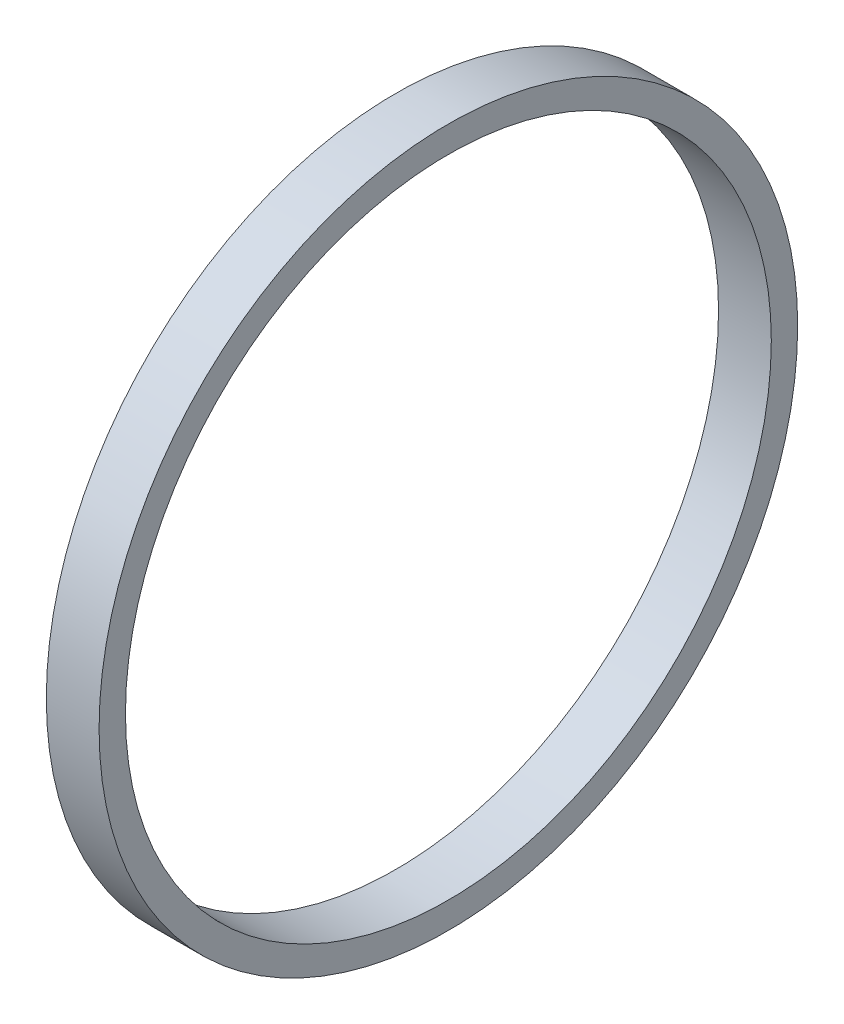
ISO-10303-21;
HEADER;
FILE_DESCRIPTION(('STEP AP214'),'2;1');
FILE_NAME('part.step','',(''),(''),'','','');
FILE_SCHEMA(('AUTOMOTIVE_DESIGN { 1 0 10303 214 1 1 1 1 }'));
ENDSEC;
DATA;
#1=APPLICATION_CONTEXT('core data for automotive mechanical design processes');
#2=APPLICATION_PROTOCOL_DEFINITION('international standard','automotive_design',2000,#1);
#3=PRODUCT_CONTEXT('',#1,'mechanical');
#4=PRODUCT('Part','Part','',(#3));
#5=PRODUCT_RELATED_PRODUCT_CATEGORY('part','',(#4));
#6=PRODUCT_DEFINITION_FORMATION('','',#4);
#7=PRODUCT_DEFINITION_CONTEXT('part definition',#1,'design');
#8=PRODUCT_DEFINITION('design','',#6,#7);
#9=PRODUCT_DEFINITION_SHAPE('','',#8);
#10=(LENGTH_UNIT() NAMED_UNIT(*) SI_UNIT(.MILLI.,.METRE.));
#11=(NAMED_UNIT(*) PLANE_ANGLE_UNIT() SI_UNIT($,.RADIAN.));
#12=(NAMED_UNIT(*) SI_UNIT($,.STERADIAN.) SOLID_ANGLE_UNIT());
#13=UNCERTAINTY_MEASURE_WITH_UNIT(LENGTH_MEASURE(1.E-05),#10,'distance_accuracy_value','');
#14=(GEOMETRIC_REPRESENTATION_CONTEXT(3) GLOBAL_UNCERTAINTY_ASSIGNED_CONTEXT((#13)) GLOBAL_UNIT_ASSIGNED_CONTEXT((#10,
#11,#12)) REPRESENTATION_CONTEXT('',''));
#15=CARTESIAN_POINT('',(0.,0.,0.));
#16=DIRECTION('',(0.,0.,1.));
#17=DIRECTION('',(1.,0.,0.));
#18=AXIS2_PLACEMENT_3D('',#15,#16,#17);
#19=CARTESIAN_POINT('',(3.175,0.,0.));
#20=DIRECTION('',(1.,0.,0.));
#21=DIRECTION('',(0.,0.,-1.));
#22=AXIS2_PLACEMENT_3D('',#19,#20,#21);
#23=PLANE('',#22);
#24=CARTESIAN_POINT('',(3.175,0.,0.));
#25=DIRECTION('',(1.,0.,0.));
#26=DIRECTION('',(0.,0.,-1.));
#27=AXIS2_PLACEMENT_3D('',#24,#25,#26);
#28=CIRCLE('',#27,21.0211848835775);
#29=CARTESIAN_POINT('',(3.175,0.,-21.0211848835775));
#30=VERTEX_POINT('',#29);
#31=EDGE_CURVE('E10',#30,#30,#28,.T.);
#32=ORIENTED_EDGE('',*,*,#31,.T.);
#33=EDGE_LOOP('',(#32));
#34=FACE_BOUND('',#33,.T.);
#35=CARTESIAN_POINT('',(3.175,0.,0.));
#36=DIRECTION('',(1.,0.,0.));
#37=DIRECTION('',(0.,0.,-1.));
#38=AXIS2_PLACEMENT_3D('',#35,#36,#37);
#39=CIRCLE('',#38,19.4336848835775);
#40=CARTESIAN_POINT('',(3.175,0.,-19.4336848835775));
#41=VERTEX_POINT('',#40);
#42=EDGE_CURVE('E39',#41,#41,#39,.T.);
#43=ORIENTED_EDGE('',*,*,#42,.F.);
#44=EDGE_LOOP('',(#43));
#45=FACE_BOUND('',#44,.T.);
#46=ADVANCED_FACE('F28',(#34,#45),#23,.T.);
#47=CARTESIAN_POINT('',(0.,0.,0.));
#48=DIRECTION('',(1.,0.,0.));
#49=DIRECTION('',(0.,0.,-1.));
#50=AXIS2_PLACEMENT_3D('',#47,#48,#49);
#51=PLANE('',#50);
#52=CARTESIAN_POINT('',(0.,0.,0.));
#53=DIRECTION('',(1.,0.,0.));
#54=DIRECTION('',(0.,0.,-1.));
#55=AXIS2_PLACEMENT_3D('',#52,#53,#54);
#56=CIRCLE('',#55,21.0211848835775);
#57=CARTESIAN_POINT('',(0.,0.,-21.0211848835775));
#58=VERTEX_POINT('',#57);
#59=EDGE_CURVE('E32',#58,#58,#56,.T.);
#60=ORIENTED_EDGE('',*,*,#59,.F.);
#61=EDGE_LOOP('',(#60));
#62=FACE_BOUND('',#61,.T.);
#63=CARTESIAN_POINT('',(0.,0.,0.));
#64=DIRECTION('',(1.,0.,0.));
#65=DIRECTION('',(0.,0.,-1.));
#66=AXIS2_PLACEMENT_3D('',#63,#64,#65);
#67=CIRCLE('',#66,19.4336848835775);
#68=CARTESIAN_POINT('',(0.,0.,-19.4336848835775));
#69=VERTEX_POINT('',#68);
#70=EDGE_CURVE('E41',#69,#69,#67,.T.);
#71=ORIENTED_EDGE('',*,*,#70,.T.);
#72=EDGE_LOOP('',(#71));
#73=FACE_BOUND('',#72,.T.);
#74=ADVANCED_FACE('F51',(#62,#73),#51,.F.);
#75=CARTESIAN_POINT('',(3.175,0.,0.));
#76=DIRECTION('',(-1.,0.,0.));
#77=DIRECTION('',(0.,0.,1.));
#78=AXIS2_PLACEMENT_3D('',#75,#76,#77);
#79=CYLINDRICAL_SURFACE('',#78,21.0211848835775);
#80=ORIENTED_EDGE('',*,*,#31,.F.);
#81=EDGE_LOOP('',(#80));
#82=FACE_BOUND('',#81,.T.);
#83=ORIENTED_EDGE('',*,*,#59,.T.);
#84=EDGE_LOOP('',(#83));
#85=FACE_BOUND('',#84,.T.);
#86=ADVANCED_FACE('F30',(#82,#85),#79,.T.);
#87=CARTESIAN_POINT('',(3.175,0.,0.));
#88=DIRECTION('',(-1.,0.,0.));
#89=DIRECTION('',(0.,0.,1.));
#90=AXIS2_PLACEMENT_3D('',#87,#88,#89);
#91=CYLINDRICAL_SURFACE('',#90,19.4336848835775);
#92=ORIENTED_EDGE('',*,*,#42,.T.);
#93=EDGE_LOOP('',(#92));
#94=FACE_BOUND('',#93,.T.);
#95=ORIENTED_EDGE('',*,*,#70,.F.);
#96=EDGE_LOOP('',(#95));
#97=FACE_BOUND('',#96,.T.);
#98=ADVANCED_FACE('F47',(#94,#97),#91,.F.);
#99=CLOSED_SHELL('',(#46,#74,#86,#98));
#100=MANIFOLD_SOLID_BREP('B2',#99);
#101=ADVANCED_BREP_SHAPE_REPRESENTATION('',(#18,#100),#14);
#102=SHAPE_DEFINITION_REPRESENTATION(#9,#101);
ENDSEC;
END-ISO-10303-21;
